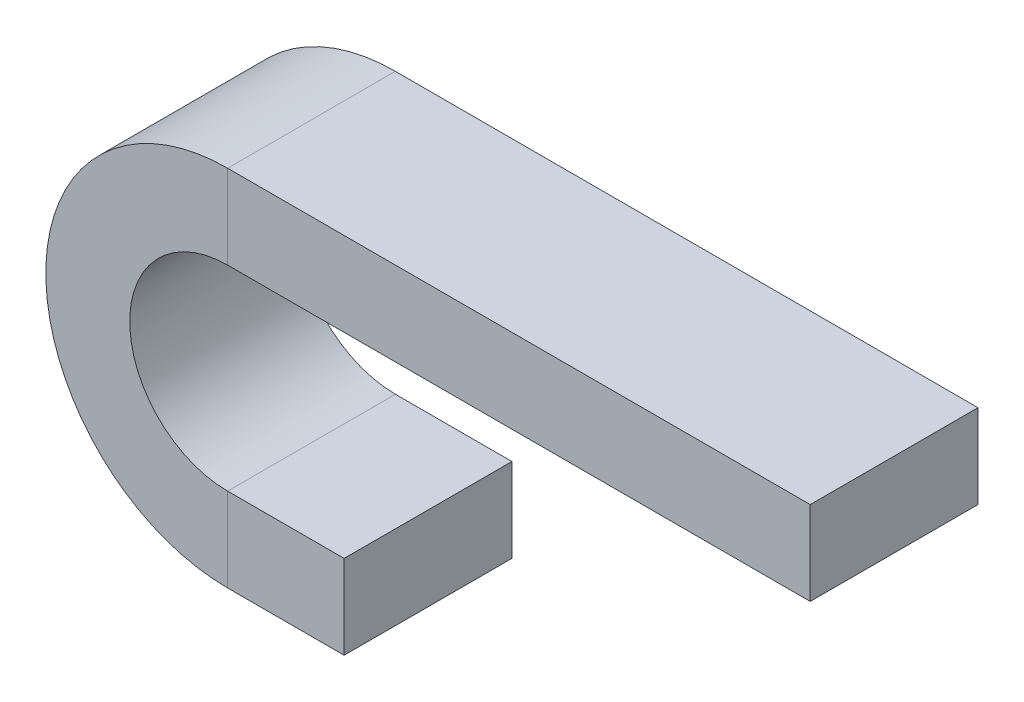
ISO-10303-21;
HEADER;
FILE_DESCRIPTION(('STEP AP214'),'2;1');
FILE_NAME('part.step','',(''),(''),'','','');
FILE_SCHEMA(('AUTOMOTIVE_DESIGN { 1 0 10303 214 1 1 1 1 }'));
ENDSEC;
DATA;
#1=APPLICATION_CONTEXT('core data for automotive mechanical design processes');
#2=APPLICATION_PROTOCOL_DEFINITION('international standard','automotive_design',2000,#1);
#3=PRODUCT_CONTEXT('',#1,'mechanical');
#4=PRODUCT('Part','Part','',(#3));
#5=PRODUCT_RELATED_PRODUCT_CATEGORY('part','',(#4));
#6=PRODUCT_DEFINITION_FORMATION('','',#4);
#7=PRODUCT_DEFINITION_CONTEXT('part definition',#1,'design');
#8=PRODUCT_DEFINITION('design','',#6,#7);
#9=PRODUCT_DEFINITION_SHAPE('','',#8);
#10=(LENGTH_UNIT() NAMED_UNIT(*) SI_UNIT(.MILLI.,.METRE.));
#11=(NAMED_UNIT(*) PLANE_ANGLE_UNIT() SI_UNIT($,.RADIAN.));
#12=(NAMED_UNIT(*) SI_UNIT($,.STERADIAN.) SOLID_ANGLE_UNIT());
#13=UNCERTAINTY_MEASURE_WITH_UNIT(LENGTH_MEASURE(1.E-05),#10,'distance_accuracy_value','');
#14=(GEOMETRIC_REPRESENTATION_CONTEXT(3) GLOBAL_UNCERTAINTY_ASSIGNED_CONTEXT((#13)) GLOBAL_UNIT_ASSIGNED_CONTEXT((#10,
#11,#12)) REPRESENTATION_CONTEXT('',''));
#15=CARTESIAN_POINT('',(0.,0.,0.));
#16=DIRECTION('',(0.,0.,1.));
#17=DIRECTION('',(1.,0.,0.));
#18=AXIS2_PLACEMENT_3D('',#15,#16,#17);
#19=CARTESIAN_POINT('',(0.,0.,0.));
#20=DIRECTION('',(1.,0.,0.));
#21=DIRECTION('',(0.,0.,-1.));
#22=AXIS2_PLACEMENT_3D('',#19,#20,#21);
#23=PLANE('',#22);
#24=DIRECTION('',(0.,-1.,0.));
#25=VECTOR('',#24,1.);
#26=CARTESIAN_POINT('',(0.,-18.,36.));
#27=LINE('',#26,#25);
#28=CARTESIAN_POINT('',(0.,18.,36.));
#29=VERTEX_POINT('',#28);
#30=CARTESIAN_POINT('',(0.,-18.,36.));
#31=VERTEX_POINT('',#30);
#32=EDGE_CURVE('E133',#29,#31,#27,.T.);
#33=ORIENTED_EDGE('',*,*,#32,.T.);
#34=DIRECTION('',(0.,0.,-1.));
#35=VECTOR('',#34,1.);
#36=CARTESIAN_POINT('',(0.,-18.,-36.));
#37=LINE('',#36,#35);
#38=CARTESIAN_POINT('',(0.,-18.,-36.));
#39=VERTEX_POINT('',#38);
#40=EDGE_CURVE('E132',#31,#39,#37,.T.);
#41=ORIENTED_EDGE('',*,*,#40,.T.);
#42=DIRECTION('',(0.,1.,0.));
#43=VECTOR('',#42,1.);
#44=CARTESIAN_POINT('',(0.,-18.,-36.));
#45=LINE('',#44,#43);
#46=CARTESIAN_POINT('',(0.,18.,-36.));
#47=VERTEX_POINT('',#46);
#48=EDGE_CURVE('E119',#39,#47,#45,.T.);
#49=ORIENTED_EDGE('',*,*,#48,.T.);
#50=DIRECTION('',(0.,0.,1.));
#51=VECTOR('',#50,1.);
#52=CARTESIAN_POINT('',(0.,18.,-36.));
#53=LINE('',#52,#51);
#54=EDGE_CURVE('E129',#47,#29,#53,.T.);
#55=ORIENTED_EDGE('',*,*,#54,.T.);
#56=EDGE_LOOP('',(#33,#41,#49,#55));
#57=FACE_BOUND('',#56,.T.);
#58=ADVANCED_FACE('F35',(#57),#23,.T.);
#59=CARTESIAN_POINT('',(200.,120.,0.));
#60=DIRECTION('',(-1.,0.,0.));
#61=DIRECTION('',(0.,0.,-1.));
#62=AXIS2_PLACEMENT_3D('',#59,#60,#61);
#63=PLANE('',#62);
#64=DIRECTION('',(0.,1.,0.));
#65=VECTOR('',#64,1.);
#66=CARTESIAN_POINT('',(200.,138.,36.));
#67=LINE('',#66,#65);
#68=CARTESIAN_POINT('',(200.,102.,36.));
#69=VERTEX_POINT('',#68);
#70=CARTESIAN_POINT('',(200.,138.,36.));
#71=VERTEX_POINT('',#70);
#72=EDGE_CURVE('E49',#69,#71,#67,.T.);
#73=ORIENTED_EDGE('',*,*,#72,.F.);
#74=DIRECTION('',(0.,0.,1.));
#75=VECTOR('',#74,1.);
#76=CARTESIAN_POINT('',(200.,102.,-36.));
#77=LINE('',#76,#75);
#78=CARTESIAN_POINT('',(200.,102.,-36.));
#79=VERTEX_POINT('',#78);
#80=EDGE_CURVE('E58',#79,#69,#77,.T.);
#81=ORIENTED_EDGE('',*,*,#80,.F.);
#82=DIRECTION('',(0.,-1.,0.));
#83=VECTOR('',#82,1.);
#84=CARTESIAN_POINT('',(200.,138.,-36.));
#85=LINE('',#84,#83);
#86=CARTESIAN_POINT('',(200.,138.,-36.));
#87=VERTEX_POINT('',#86);
#88=EDGE_CURVE('E154',#87,#79,#85,.T.);
#89=ORIENTED_EDGE('',*,*,#88,.F.);
#90=DIRECTION('',(0.,0.,-1.));
#91=VECTOR('',#90,1.);
#92=CARTESIAN_POINT('',(200.,138.,-36.));
#93=LINE('',#92,#91);
#94=EDGE_CURVE('E11',#71,#87,#93,.T.);
#95=ORIENTED_EDGE('',*,*,#94,.F.);
#96=EDGE_LOOP('',(#73,#81,#89,#95));
#97=FACE_BOUND('',#96,.T.);
#98=ADVANCED_FACE('F215',(#97),#63,.F.);
#99=CARTESIAN_POINT('',(0.,-18.,-36.));
#100=DIRECTION('',(0.,0.,1.));
#101=DIRECTION('',(1.,0.,0.));
#102=AXIS2_PLACEMENT_3D('',#99,#100,#101);
#103=PLANE('',#102);
#104=DIRECTION('',(-1.,0.,0.));
#105=VECTOR('',#104,1.);
#106=CARTESIAN_POINT('',(0.,18.,-36.));
#107=LINE('',#106,#105);
#108=CARTESIAN_POINT('',(-50.,18.,-36.));
#109=VERTEX_POINT('',#108);
#110=EDGE_CURVE('E126',#47,#109,#107,.T.);
#111=ORIENTED_EDGE('',*,*,#110,.F.);
#112=ORIENTED_EDGE('',*,*,#48,.F.);
#113=DIRECTION('',(-1.,0.,0.));
#114=VECTOR('',#113,1.);
#115=CARTESIAN_POINT('',(0.,-18.,-36.));
#116=LINE('',#115,#114);
#117=CARTESIAN_POINT('',(-50.,-18.,-36.));
#118=VERTEX_POINT('',#117);
#119=EDGE_CURVE('E124',#39,#118,#116,.T.);
#120=ORIENTED_EDGE('',*,*,#119,.T.);
#121=DIRECTION('',(0.,1.,0.));
#122=VECTOR('',#121,1.);
#123=CARTESIAN_POINT('',(-50.,-18.,-36.));
#124=LINE('',#123,#122);
#125=EDGE_CURVE('E142',#118,#109,#124,.T.);
#126=ORIENTED_EDGE('',*,*,#125,.T.);
#127=EDGE_LOOP('',(#111,#112,#120,#126));
#128=FACE_BOUND('',#127,.T.);
#129=ADVANCED_FACE('F121',(#128),#103,.F.);
#130=CARTESIAN_POINT('',(0.,18.,-36.));
#131=DIRECTION('',(0.,-1.,0.));
#132=DIRECTION('',(1.,0.,0.));
#133=AXIS2_PLACEMENT_3D('',#130,#131,#132);
#134=PLANE('',#133);
#135=DIRECTION('',(-1.,0.,0.));
#136=VECTOR('',#135,1.);
#137=CARTESIAN_POINT('',(0.,18.,36.));
#138=LINE('',#137,#136);
#139=CARTESIAN_POINT('',(-50.,18.,36.));
#140=VERTEX_POINT('',#139);
#141=EDGE_CURVE('E165',#29,#140,#138,.T.);
#142=ORIENTED_EDGE('',*,*,#141,.F.);
#143=ORIENTED_EDGE('',*,*,#54,.F.);
#144=ORIENTED_EDGE('',*,*,#110,.T.);
#145=DIRECTION('',(0.,0.,1.));
#146=VECTOR('',#145,1.);
#147=CARTESIAN_POINT('',(-50.,18.,-36.));
#148=LINE('',#147,#146);
#149=EDGE_CURVE('E162',#109,#140,#148,.T.);
#150=ORIENTED_EDGE('',*,*,#149,.T.);
#151=EDGE_LOOP('',(#142,#143,#144,#150));
#152=FACE_BOUND('',#151,.T.);
#153=ADVANCED_FACE('F222',(#152),#134,.F.);
#154=CARTESIAN_POINT('',(0.,-18.,36.));
#155=DIRECTION('',(0.,0.,-1.));
#156=DIRECTION('',(-1.,0.,0.));
#157=AXIS2_PLACEMENT_3D('',#154,#155,#156);
#158=PLANE('',#157);
#159=DIRECTION('',(-1.,0.,0.));
#160=VECTOR('',#159,1.);
#161=CARTESIAN_POINT('',(0.,-18.,36.));
#162=LINE('',#161,#160);
#163=CARTESIAN_POINT('',(-50.,-18.,36.));
#164=VERTEX_POINT('',#163);
#165=EDGE_CURVE('E177',#31,#164,#162,.T.);
#166=ORIENTED_EDGE('',*,*,#165,.F.);
#167=ORIENTED_EDGE('',*,*,#32,.F.);
#168=ORIENTED_EDGE('',*,*,#141,.T.);
#169=DIRECTION('',(0.,-1.,0.));
#170=VECTOR('',#169,1.);
#171=CARTESIAN_POINT('',(-50.,-18.,36.));
#172=LINE('',#171,#170);
#173=EDGE_CURVE('E168',#140,#164,#172,.T.);
#174=ORIENTED_EDGE('',*,*,#173,.T.);
#175=EDGE_LOOP('',(#166,#167,#168,#174));
#176=FACE_BOUND('',#175,.T.);
#177=ADVANCED_FACE('F201',(#176),#158,.F.);
#178=CARTESIAN_POINT('',(0.,-18.,-36.));
#179=DIRECTION('',(0.,1.,0.));
#180=DIRECTION('',(-1.,0.,0.));
#181=AXIS2_PLACEMENT_3D('',#178,#179,#180);
#182=PLANE('',#181);
#183=DIRECTION('',(0.,0.,-1.));
#184=VECTOR('',#183,1.);
#185=CARTESIAN_POINT('',(-50.,-18.,-36.));
#186=LINE('',#185,#184);
#187=EDGE_CURVE('E141',#164,#118,#186,.T.);
#188=ORIENTED_EDGE('',*,*,#187,.T.);
#189=ORIENTED_EDGE('',*,*,#119,.F.);
#190=ORIENTED_EDGE('',*,*,#40,.F.);
#191=ORIENTED_EDGE('',*,*,#165,.T.);
#192=EDGE_LOOP('',(#188,#189,#190,#191));
#193=FACE_BOUND('',#192,.T.);
#194=ADVANCED_FACE('F139',(#193),#182,.F.);
#195=CARTESIAN_POINT('',(-50.,-18.,-36.));
#196=DIRECTION('',(0.,0.,1.));
#197=DIRECTION('',(1.,0.,0.));
#198=AXIS2_PLACEMENT_3D('',#195,#196,#197);
#199=PLANE('',#198);
#200=CARTESIAN_POINT('',(-50.,60.,-36.));
#201=DIRECTION('',(0.,0.,-1.));
#202=DIRECTION('',(0.,-1.,0.));
#203=AXIS2_PLACEMENT_3D('',#200,#201,#202);
#204=CIRCLE('',#203,42.);
#205=CARTESIAN_POINT('',(-50.,102.,-36.));
#206=VERTEX_POINT('',#205);
#207=EDGE_CURVE('E107',#109,#206,#204,.T.);
#208=ORIENTED_EDGE('',*,*,#207,.F.);
#209=ORIENTED_EDGE('',*,*,#125,.F.);
#210=CARTESIAN_POINT('',(-50.,60.,-36.));
#211=DIRECTION('',(0.,0.,-1.));
#212=DIRECTION('',(0.,-1.,0.));
#213=AXIS2_PLACEMENT_3D('',#210,#211,#212);
#214=CIRCLE('',#213,78.);
#215=CARTESIAN_POINT('',(-50.,138.,-36.));
#216=VERTEX_POINT('',#215);
#217=EDGE_CURVE('E149',#118,#216,#214,.T.);
#218=ORIENTED_EDGE('',*,*,#217,.T.);
#219=DIRECTION('',(0.,-1.,0.));
#220=VECTOR('',#219,1.);
#221=CARTESIAN_POINT('',(-50.,138.,-36.));
#222=LINE('',#221,#220);
#223=EDGE_CURVE('E147',#216,#206,#222,.T.);
#224=ORIENTED_EDGE('',*,*,#223,.T.);
#225=EDGE_LOOP('',(#208,#209,#218,#224));
#226=FACE_BOUND('',#225,.T.);
#227=ADVANCED_FACE('F191',(#226),#199,.F.);
#228=CARTESIAN_POINT('',(-50.,60.,0.));
#229=DIRECTION('',(0.,0.,-1.));
#230=DIRECTION('',(-1.,0.,0.));
#231=AXIS2_PLACEMENT_3D('',#228,#229,#230);
#232=CYLINDRICAL_SURFACE('',#231,42.);
#233=CARTESIAN_POINT('',(-50.,60.,36.));
#234=DIRECTION('',(0.,0.,-1.));
#235=DIRECTION('',(0.,-1.,0.));
#236=AXIS2_PLACEMENT_3D('',#233,#234,#235);
#237=CIRCLE('',#236,42.);
#238=CARTESIAN_POINT('',(-50.,102.,36.));
#239=VERTEX_POINT('',#238);
#240=EDGE_CURVE('E100',#140,#239,#237,.T.);
#241=ORIENTED_EDGE('',*,*,#240,.F.);
#242=ORIENTED_EDGE('',*,*,#149,.F.);
#243=ORIENTED_EDGE('',*,*,#207,.T.);
#244=DIRECTION('',(0.,0.,1.));
#245=VECTOR('',#244,1.);
#246=CARTESIAN_POINT('',(-50.,102.,-36.));
#247=LINE('',#246,#245);
#248=EDGE_CURVE('E151',#206,#239,#247,.T.);
#249=ORIENTED_EDGE('',*,*,#248,.T.);
#250=EDGE_LOOP('',(#241,#242,#243,#249));
#251=FACE_BOUND('',#250,.T.);
#252=ADVANCED_FACE('F193',(#251),#232,.F.);
#253=CARTESIAN_POINT('',(-50.,-18.,36.));
#254=DIRECTION('',(0.,0.,-1.));
#255=DIRECTION('',(-1.,0.,0.));
#256=AXIS2_PLACEMENT_3D('',#253,#254,#255);
#257=PLANE('',#256);
#258=CARTESIAN_POINT('',(-50.,60.,36.));
#259=DIRECTION('',(0.,0.,-1.));
#260=DIRECTION('',(0.,-1.,0.));
#261=AXIS2_PLACEMENT_3D('',#258,#259,#260);
#262=CIRCLE('',#261,78.);
#263=CARTESIAN_POINT('',(-50.,138.,36.));
#264=VERTEX_POINT('',#263);
#265=EDGE_CURVE('E181',#164,#264,#262,.T.);
#266=ORIENTED_EDGE('',*,*,#265,.F.);
#267=ORIENTED_EDGE('',*,*,#173,.F.);
#268=ORIENTED_EDGE('',*,*,#240,.T.);
#269=DIRECTION('',(0.,1.,0.));
#270=VECTOR('',#269,1.);
#271=CARTESIAN_POINT('',(-50.,138.,36.));
#272=LINE('',#271,#270);
#273=EDGE_CURVE('E171',#239,#264,#272,.T.);
#274=ORIENTED_EDGE('',*,*,#273,.T.);
#275=EDGE_LOOP('',(#266,#267,#268,#274));
#276=FACE_BOUND('',#275,.T.);
#277=ADVANCED_FACE('F199',(#276),#257,.F.);
#278=CARTESIAN_POINT('',(-50.,60.,0.));
#279=DIRECTION('',(0.,0.,-1.));
#280=DIRECTION('',(-1.,0.,0.));
#281=AXIS2_PLACEMENT_3D('',#278,#279,#280);
#282=CYLINDRICAL_SURFACE('',#281,78.);
#283=DIRECTION('',(0.,0.,-1.));
#284=VECTOR('',#283,1.);
#285=CARTESIAN_POINT('',(-50.,138.,-36.));
#286=LINE('',#285,#284);
#287=EDGE_CURVE('E160',#264,#216,#286,.T.);
#288=ORIENTED_EDGE('',*,*,#287,.T.);
#289=ORIENTED_EDGE('',*,*,#217,.F.);
#290=ORIENTED_EDGE('',*,*,#187,.F.);
#291=ORIENTED_EDGE('',*,*,#265,.T.);
#292=EDGE_LOOP('',(#288,#289,#290,#291));
#293=FACE_BOUND('',#292,.T.);
#294=ADVANCED_FACE('F188',(#293),#282,.T.);
#295=CARTESIAN_POINT('',(-50.,138.,-36.));
#296=DIRECTION('',(0.,0.,1.));
#297=DIRECTION('',(1.,0.,0.));
#298=AXIS2_PLACEMENT_3D('',#295,#296,#297);
#299=PLANE('',#298);
#300=DIRECTION('',(1.,0.,0.));
#301=VECTOR('',#300,1.);
#302=CARTESIAN_POINT('',(-50.,102.,-36.));
#303=LINE('',#302,#301);
#304=EDGE_CURVE('E87',#206,#79,#303,.T.);
#305=ORIENTED_EDGE('',*,*,#304,.F.);
#306=ORIENTED_EDGE('',*,*,#223,.F.);
#307=DIRECTION('',(1.,0.,0.));
#308=VECTOR('',#307,1.);
#309=CARTESIAN_POINT('',(-50.,138.,-36.));
#310=LINE('',#309,#308);
#311=EDGE_CURVE('E156',#216,#87,#310,.T.);
#312=ORIENTED_EDGE('',*,*,#311,.T.);
#313=ORIENTED_EDGE('',*,*,#88,.T.);
#314=EDGE_LOOP('',(#305,#306,#312,#313));
#315=FACE_BOUND('',#314,.T.);
#316=ADVANCED_FACE('F190',(#315),#299,.F.);
#317=CARTESIAN_POINT('',(-50.,102.,-36.));
#318=DIRECTION('',(0.,1.,0.));
#319=DIRECTION('',(0.,0.,1.));
#320=AXIS2_PLACEMENT_3D('',#317,#318,#319);
#321=PLANE('',#320);
#322=DIRECTION('',(1.,0.,0.));
#323=VECTOR('',#322,1.);
#324=CARTESIAN_POINT('',(-50.,102.,36.));
#325=LINE('',#324,#323);
#326=EDGE_CURVE('E82',#239,#69,#325,.T.);
#327=ORIENTED_EDGE('',*,*,#326,.F.);
#328=ORIENTED_EDGE('',*,*,#248,.F.);
#329=ORIENTED_EDGE('',*,*,#304,.T.);
#330=ORIENTED_EDGE('',*,*,#80,.T.);
#331=EDGE_LOOP('',(#327,#328,#329,#330));
#332=FACE_BOUND('',#331,.T.);
#333=ADVANCED_FACE('F212',(#332),#321,.F.);
#334=CARTESIAN_POINT('',(-50.,138.,36.));
#335=DIRECTION('',(0.,0.,-1.));
#336=DIRECTION('',(-1.,0.,0.));
#337=AXIS2_PLACEMENT_3D('',#334,#335,#336);
#338=PLANE('',#337);
#339=DIRECTION('',(1.,0.,0.));
#340=VECTOR('',#339,1.);
#341=CARTESIAN_POINT('',(-50.,138.,36.));
#342=LINE('',#341,#340);
#343=EDGE_CURVE('E42',#264,#71,#342,.T.);
#344=ORIENTED_EDGE('',*,*,#343,.F.);
#345=ORIENTED_EDGE('',*,*,#273,.F.);
#346=ORIENTED_EDGE('',*,*,#326,.T.);
#347=ORIENTED_EDGE('',*,*,#72,.T.);
#348=EDGE_LOOP('',(#344,#345,#346,#347));
#349=FACE_BOUND('',#348,.T.);
#350=ADVANCED_FACE('F207',(#349),#338,.F.);
#351=CARTESIAN_POINT('',(-50.,138.,-36.));
#352=DIRECTION('',(0.,-1.,0.));
#353=DIRECTION('',(0.,0.,-1.));
#354=AXIS2_PLACEMENT_3D('',#351,#352,#353);
#355=PLANE('',#354);
#356=ORIENTED_EDGE('',*,*,#94,.T.);
#357=ORIENTED_EDGE('',*,*,#311,.F.);
#358=ORIENTED_EDGE('',*,*,#287,.F.);
#359=ORIENTED_EDGE('',*,*,#343,.T.);
#360=EDGE_LOOP('',(#356,#357,#358,#359));
#361=FACE_BOUND('',#360,.T.);
#362=ADVANCED_FACE('F205',(#361),#355,.F.);
#363=CLOSED_SHELL('',(#58,#98,#129,#153,#177,#194,#227,#252,#277,#294,#316,#333,#350,#362));
#364=MANIFOLD_SOLID_BREP('B2',#363);
#365=ADVANCED_BREP_SHAPE_REPRESENTATION('',(#18,#364),#14);
#366=SHAPE_DEFINITION_REPRESENTATION(#9,#365);
ENDSEC;
END-ISO-10303-21;
